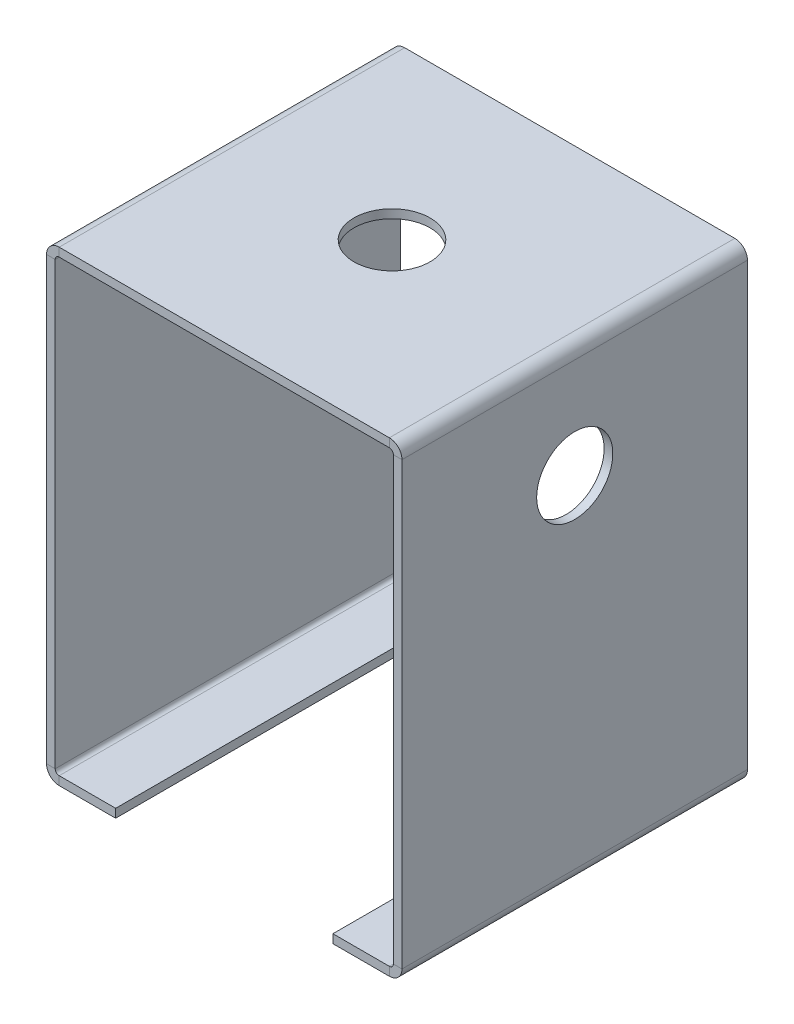
ISO-10303-21;
HEADER;
FILE_DESCRIPTION(('STEP AP214'),'2;1');
FILE_NAME('part.step','',(''),(''),'','','');
FILE_SCHEMA(('AUTOMOTIVE_DESIGN { 1 0 10303 214 1 1 1 1 }'));
ENDSEC;
DATA;
#1=APPLICATION_CONTEXT('core data for automotive mechanical design processes');
#2=APPLICATION_PROTOCOL_DEFINITION('international standard','automotive_design',2000,#1);
#3=PRODUCT_CONTEXT('',#1,'mechanical');
#4=PRODUCT('Part','Part','',(#3));
#5=PRODUCT_RELATED_PRODUCT_CATEGORY('part','',(#4));
#6=PRODUCT_DEFINITION_FORMATION('','',#4);
#7=PRODUCT_DEFINITION_CONTEXT('part definition',#1,'design');
#8=PRODUCT_DEFINITION('design','',#6,#7);
#9=PRODUCT_DEFINITION_SHAPE('','',#8);
#10=(LENGTH_UNIT() NAMED_UNIT(*) SI_UNIT(.MILLI.,.METRE.));
#11=(NAMED_UNIT(*) PLANE_ANGLE_UNIT() SI_UNIT($,.RADIAN.));
#12=(NAMED_UNIT(*) SI_UNIT($,.STERADIAN.) SOLID_ANGLE_UNIT());
#13=UNCERTAINTY_MEASURE_WITH_UNIT(LENGTH_MEASURE(1.E-05),#10,'distance_accuracy_value','');
#14=(GEOMETRIC_REPRESENTATION_CONTEXT(3) GLOBAL_UNCERTAINTY_ASSIGNED_CONTEXT((#13)) GLOBAL_UNIT_ASSIGNED_CONTEXT((#10,
#11,#12)) REPRESENTATION_CONTEXT('',''));
#15=CARTESIAN_POINT('',(0.,0.,0.));
#16=DIRECTION('',(0.,0.,1.));
#17=DIRECTION('',(1.,0.,0.));
#18=AXIS2_PLACEMENT_3D('',#15,#16,#17);
#19=CARTESIAN_POINT('',(-63.7499999440006,2.19380097704199E-13,0.));
#20=DIRECTION('',(0.,0.,1.));
#21=DIRECTION('',(1.,0.,0.));
#22=AXIS2_PLACEMENT_3D('',#19,#20,#21);
#23=PLANE('',#22);
#24=DIRECTION('',(-1.,0.,0.));
#25=VECTOR('',#24,1.);
#26=CARTESIAN_POINT('',(-62.1624999440006,0.736600000000206,0.));
#27=LINE('',#26,#25);
#28=CARTESIAN_POINT('',(-62.1624999440006,0.736600000000201,0.));
#29=VERTEX_POINT('',#28);
#30=CARTESIAN_POINT('',(-63.7499999440006,0.736600000000207,0.));
#31=VERTEX_POINT('',#30);
#32=EDGE_CURVE('E236',#29,#31,#27,.T.);
#33=ORIENTED_EDGE('',*,*,#32,.T.);
#34=DIRECTION('',(0.,-1.,0.));
#35=VECTOR('',#34,1.);
#36=CARTESIAN_POINT('',(-63.7499999440006,2.19380097704199E-13,0.));
#37=LINE('',#36,#35);
#38=CARTESIAN_POINT('',(-63.749999944,81.8134000000002,0.));
#39=VERTEX_POINT('',#38);
#40=EDGE_CURVE('E259',#39,#31,#37,.T.);
#41=ORIENTED_EDGE('',*,*,#40,.F.);
#42=DIRECTION('',(-1.,0.,0.));
#43=VECTOR('',#42,1.);
#44=CARTESIAN_POINT('',(-62.162499944,81.8134000000002,0.));
#45=LINE('',#44,#43);
#46=CARTESIAN_POINT('',(-62.162499944,81.8134000000002,0.));
#47=VERTEX_POINT('',#46);
#48=EDGE_CURVE('E250',#47,#39,#45,.T.);
#49=ORIENTED_EDGE('',*,*,#48,.F.);
#50=DIRECTION('',(0.,-1.,0.));
#51=VECTOR('',#50,1.);
#52=CARTESIAN_POINT('',(-62.1624999440006,2.08166817117217E-13,0.));
#53=LINE('',#52,#51);
#54=EDGE_CURVE('E258',#47,#29,#53,.T.);
#55=ORIENTED_EDGE('',*,*,#54,.T.);
#56=EDGE_LOOP('',(#33,#41,#49,#55));
#57=FACE_BOUND('',#56,.T.);
#58=ADVANCED_FACE('F39',(#57),#23,.F.);
#59=CARTESIAN_POINT('',(-63.749999944,82.5500000000002,63.5));
#60=DIRECTION('',(0.,0.,-1.));
#61=DIRECTION('',(-1.,0.,0.));
#62=AXIS2_PLACEMENT_3D('',#59,#60,#61);
#63=PLANE('',#62);
#64=DIRECTION('',(-1.,0.,0.));
#65=VECTOR('',#64,1.);
#66=CARTESIAN_POINT('',(-62.1624999440006,0.736600000000197,63.5));
#67=LINE('',#66,#65);
#68=CARTESIAN_POINT('',(-62.1624999440006,0.736600000000197,63.5));
#69=VERTEX_POINT('',#68);
#70=CARTESIAN_POINT('',(-63.7499999440006,0.736600000000208,63.5));
#71=VERTEX_POINT('',#70);
#72=EDGE_CURVE('E242',#69,#71,#67,.T.);
#73=ORIENTED_EDGE('',*,*,#72,.F.);
#74=DIRECTION('',(0.,1.,0.));
#75=VECTOR('',#74,1.);
#76=CARTESIAN_POINT('',(-62.162499944,82.5500000000002,63.5));
#77=LINE('',#76,#75);
#78=CARTESIAN_POINT('',(-62.162499944,81.8134000000002,63.5));
#79=VERTEX_POINT('',#78);
#80=EDGE_CURVE('E262',#69,#79,#77,.T.);
#81=ORIENTED_EDGE('',*,*,#80,.T.);
#82=DIRECTION('',(-1.,0.,0.));
#83=VECTOR('',#82,1.);
#84=CARTESIAN_POINT('',(-62.162499944,81.8134000000002,63.5));
#85=LINE('',#84,#83);
#86=CARTESIAN_POINT('',(-63.749999944,81.8134000000002,63.5));
#87=VERTEX_POINT('',#86);
#88=EDGE_CURVE('E245',#79,#87,#85,.T.);
#89=ORIENTED_EDGE('',*,*,#88,.T.);
#90=DIRECTION('',(0.,1.,0.));
#91=VECTOR('',#90,1.);
#92=CARTESIAN_POINT('',(-63.749999944,82.5500000000002,63.5));
#93=LINE('',#92,#91);
#94=EDGE_CURVE('E261',#71,#87,#93,.T.);
#95=ORIENTED_EDGE('',*,*,#94,.F.);
#96=EDGE_LOOP('',(#73,#81,#89,#95));
#97=FACE_BOUND('',#96,.T.);
#98=ADVANCED_FACE('F457',(#97),#63,.F.);
#99=CARTESIAN_POINT('',(-63.7499999440006,4.50128790225952E-13,0.));
#100=DIRECTION('',(1.,0.,0.));
#101=DIRECTION('',(0.,1.,0.));
#102=AXIS2_PLACEMENT_3D('',#99,#100,#101);
#103=PLANE('',#102);
#104=DIRECTION('',(0.,0.,-1.));
#105=VECTOR('',#104,1.);
#106=CARTESIAN_POINT('',(-63.7499999440006,0.736600000000207,0.));
#107=LINE('',#106,#105);
#108=EDGE_CURVE('E189',#31,#71,#107,.F.);
#109=ORIENTED_EDGE('',*,*,#108,.T.);
#110=ORIENTED_EDGE('',*,*,#94,.T.);
#111=DIRECTION('',(0.,0.,1.));
#112=VECTOR('',#111,1.);
#113=CARTESIAN_POINT('',(-63.749999944,81.8134000000002,0.));
#114=LINE('',#113,#112);
#115=EDGE_CURVE('E253',#39,#87,#114,.T.);
#116=ORIENTED_EDGE('',*,*,#115,.F.);
#117=ORIENTED_EDGE('',*,*,#40,.T.);
#118=EDGE_LOOP('',(#109,#110,#116,#117));
#119=FACE_BOUND('',#118,.T.);
#120=ADVANCED_FACE('F462',(#119),#103,.F.);
#121=CARTESIAN_POINT('',(-62.1624999440006,4.3891550963897E-13,0.));
#122=DIRECTION('',(1.,0.,0.));
#123=DIRECTION('',(0.,1.,0.));
#124=AXIS2_PLACEMENT_3D('',#121,#122,#123);
#125=PLANE('',#124);
#126=ORIENTED_EDGE('',*,*,#80,.F.);
#127=DIRECTION('',(0.,0.,-1.));
#128=VECTOR('',#127,1.);
#129=CARTESIAN_POINT('',(-62.1624999440006,0.736600000000206,0.));
#130=LINE('',#129,#128);
#131=EDGE_CURVE('E56',#29,#69,#130,.F.);
#132=ORIENTED_EDGE('',*,*,#131,.F.);
#133=ORIENTED_EDGE('',*,*,#54,.F.);
#134=DIRECTION('',(0.,0.,-1.));
#135=VECTOR('',#134,1.);
#136=CARTESIAN_POINT('',(-62.162499944,81.8134000000002,63.5));
#137=LINE('',#136,#135);
#138=EDGE_CURVE('E248',#79,#47,#137,.T.);
#139=ORIENTED_EDGE('',*,*,#138,.F.);
#140=EDGE_LOOP('',(#126,#132,#133,#139));
#141=FACE_BOUND('',#140,.T.);
#142=ADVANCED_FACE('F422',(#141),#125,.T.);
#143=CARTESIAN_POINT('',(0.,84.1375,63.5));
#144=DIRECTION('',(0.,0.,-1.));
#145=DIRECTION('',(-1.,0.,0.));
#146=AXIS2_PLACEMENT_3D('',#143,#144,#145);
#147=PLANE('',#146);
#148=DIRECTION('',(0.,1.,0.));
#149=VECTOR('',#148,1.);
#150=CARTESIAN_POINT('',(-61.425899944,82.5500000000002,63.5));
#151=LINE('',#150,#149);
#152=CARTESIAN_POINT('',(-61.425899944,82.5500000000002,63.5));
#153=VERTEX_POINT('',#152);
#154=CARTESIAN_POINT('',(-61.425899944,84.1375000000002,63.5));
#155=VERTEX_POINT('',#154);
#156=EDGE_CURVE('E282',#153,#155,#151,.T.);
#157=ORIENTED_EDGE('',*,*,#156,.F.);
#158=DIRECTION('',(1.,0.,0.));
#159=VECTOR('',#158,1.);
#160=CARTESIAN_POINT('',(0.,82.55,63.5));
#161=LINE('',#160,#159);
#162=CARTESIAN_POINT('',(-0.736600000000004,82.55,63.5));
#163=VERTEX_POINT('',#162);
#164=EDGE_CURVE('E298',#153,#163,#161,.T.);
#165=ORIENTED_EDGE('',*,*,#164,.T.);
#166=DIRECTION('',(0.,1.,0.));
#167=VECTOR('',#166,1.);
#168=CARTESIAN_POINT('',(-0.736600000000004,82.55,63.5));
#169=LINE('',#168,#167);
#170=CARTESIAN_POINT('',(-0.736599999999998,84.1375,63.5));
#171=VERTEX_POINT('',#170);
#172=EDGE_CURVE('E285',#163,#171,#169,.T.);
#173=ORIENTED_EDGE('',*,*,#172,.T.);
#174=DIRECTION('',(1.,0.,0.));
#175=VECTOR('',#174,1.);
#176=CARTESIAN_POINT('',(0.,84.1375,63.5));
#177=LINE('',#176,#175);
#178=EDGE_CURVE('E299',#155,#171,#177,.T.);
#179=ORIENTED_EDGE('',*,*,#178,.F.);
#180=EDGE_LOOP('',(#157,#165,#173,#179));
#181=FACE_BOUND('',#180,.T.);
#182=ADVANCED_FACE('F580',(#181),#147,.F.);
#183=CARTESIAN_POINT('',(-62.162499944,84.1375000000002,0.));
#184=DIRECTION('',(0.,0.,1.));
#185=DIRECTION('',(1.,0.,0.));
#186=AXIS2_PLACEMENT_3D('',#183,#184,#185);
#187=PLANE('',#186);
#188=DIRECTION('',(0.,1.,0.));
#189=VECTOR('',#188,1.);
#190=CARTESIAN_POINT('',(-61.425899944,82.5500000000002,0.));
#191=LINE('',#190,#189);
#192=CARTESIAN_POINT('',(-61.425899944,82.5500000000002,0.));
#193=VERTEX_POINT('',#192);
#194=CARTESIAN_POINT('',(-61.425899944,84.1375000000002,0.));
#195=VERTEX_POINT('',#194);
#196=EDGE_CURVE('E273',#193,#195,#191,.T.);
#197=ORIENTED_EDGE('',*,*,#196,.T.);
#198=DIRECTION('',(-1.,0.,0.));
#199=VECTOR('',#198,1.);
#200=CARTESIAN_POINT('',(-62.162499944,84.1375000000002,0.));
#201=LINE('',#200,#199);
#202=CARTESIAN_POINT('',(-0.736599999999998,84.1375,0.));
#203=VERTEX_POINT('',#202);
#204=EDGE_CURVE('E301',#203,#195,#201,.T.);
#205=ORIENTED_EDGE('',*,*,#204,.F.);
#206=DIRECTION('',(0.,1.,0.));
#207=VECTOR('',#206,1.);
#208=CARTESIAN_POINT('',(-0.736600000000004,82.55,0.));
#209=LINE('',#208,#207);
#210=CARTESIAN_POINT('',(-0.736600000000004,82.55,0.));
#211=VERTEX_POINT('',#210);
#212=EDGE_CURVE('E290',#211,#203,#209,.T.);
#213=ORIENTED_EDGE('',*,*,#212,.F.);
#214=DIRECTION('',(-1.,0.,0.));
#215=VECTOR('',#214,1.);
#216=CARTESIAN_POINT('',(-62.162499944,82.5500000000002,0.));
#217=LINE('',#216,#215);
#218=EDGE_CURVE('E302',#211,#193,#217,.T.);
#219=ORIENTED_EDGE('',*,*,#218,.T.);
#220=EDGE_LOOP('',(#197,#205,#213,#219));
#221=FACE_BOUND('',#220,.T.);
#222=ADVANCED_FACE('F411',(#221),#187,.F.);
#223=CARTESIAN_POINT('',(3.00411532627006E-13,84.1375,0.));
#224=DIRECTION('',(0.,-1.,0.));
#225=DIRECTION('',(1.,0.,0.));
#226=AXIS2_PLACEMENT_3D('',#223,#224,#225);
#227=PLANE('',#226);
#228=CARTESIAN_POINT('',(-32.,84.1375000000001,31.75));
#229=DIRECTION('',(0.,1.,0.));
#230=DIRECTION('',(-1.,0.,0.));
#231=AXIS2_PLACEMENT_3D('',#228,#229,#230);
#232=CIRCLE('',#231,7.);
#233=CARTESIAN_POINT('',(-39.,84.1375000000001,31.75));
#234=VERTEX_POINT('',#233);
#235=EDGE_CURVE('E435',#234,#234,#232,.T.);
#236=ORIENTED_EDGE('',*,*,#235,.F.);
#237=EDGE_LOOP('',(#236));
#238=FACE_BOUND('',#237,.T.);
#239=DIRECTION('',(0.,0.,-1.));
#240=VECTOR('',#239,1.);
#241=CARTESIAN_POINT('',(-61.425899944,84.1375000000002,0.));
#242=LINE('',#241,#240);
#243=EDGE_CURVE('E267',#195,#155,#242,.F.);
#244=ORIENTED_EDGE('',*,*,#243,.T.);
#245=ORIENTED_EDGE('',*,*,#178,.T.);
#246=DIRECTION('',(0.,0.,1.));
#247=VECTOR('',#246,1.);
#248=CARTESIAN_POINT('',(-0.736599999999998,84.1375,0.));
#249=LINE('',#248,#247);
#250=EDGE_CURVE('E293',#203,#171,#249,.T.);
#251=ORIENTED_EDGE('',*,*,#250,.F.);
#252=ORIENTED_EDGE('',*,*,#204,.T.);
#253=EDGE_LOOP('',(#244,#245,#251,#252));
#254=FACE_BOUND('',#253,.T.);
#255=ADVANCED_FACE('F445',(#238,#254),#227,.F.);
#256=CARTESIAN_POINT('',(2.94868806001592E-13,82.55,0.));
#257=DIRECTION('',(0.,-1.,0.));
#258=DIRECTION('',(1.,0.,0.));
#259=AXIS2_PLACEMENT_3D('',#256,#257,#258);
#260=PLANE('',#259);
#261=CARTESIAN_POINT('',(-32.,82.5500000000001,31.75));
#262=DIRECTION('',(0.,-1.,0.));
#263=DIRECTION('',(1.,0.,0.));
#264=AXIS2_PLACEMENT_3D('',#261,#262,#263);
#265=CIRCLE('',#264,7.);
#266=CARTESIAN_POINT('',(-25.,82.5500000000001,31.75));
#267=VERTEX_POINT('',#266);
#268=EDGE_CURVE('E43',#267,#267,#265,.T.);
#269=ORIENTED_EDGE('',*,*,#268,.F.);
#270=EDGE_LOOP('',(#269));
#271=FACE_BOUND('',#270,.T.);
#272=ORIENTED_EDGE('',*,*,#164,.F.);
#273=DIRECTION('',(0.,0.,-1.));
#274=VECTOR('',#273,1.);
#275=CARTESIAN_POINT('',(-61.425899944,82.5500000000002,0.));
#276=LINE('',#275,#274);
#277=EDGE_CURVE('E64',#193,#153,#276,.F.);
#278=ORIENTED_EDGE('',*,*,#277,.F.);
#279=ORIENTED_EDGE('',*,*,#218,.F.);
#280=DIRECTION('',(0.,0.,-1.));
#281=VECTOR('',#280,1.);
#282=CARTESIAN_POINT('',(-0.736600000000004,82.55,63.5));
#283=LINE('',#282,#281);
#284=EDGE_CURVE('E288',#163,#211,#283,.T.);
#285=ORIENTED_EDGE('',*,*,#284,.F.);
#286=EDGE_LOOP('',(#272,#278,#279,#285));
#287=FACE_BOUND('',#286,.T.);
#288=ADVANCED_FACE('F408',(#271,#287),#260,.T.);
#289=CARTESIAN_POINT('',(1.5875,0.,63.5));
#290=DIRECTION('',(-1.,0.,0.));
#291=DIRECTION('',(0.,0.,1.));
#292=AXIS2_PLACEMENT_3D('',#289,#290,#291);
#293=PLANE('',#292);
#294=CARTESIAN_POINT('',(1.5875,63.4125,31.75));
#295=DIRECTION('',(-1.,0.,0.));
#296=DIRECTION('',(0.,0.,1.));
#297=AXIS2_PLACEMENT_3D('',#294,#295,#296);
#298=CIRCLE('',#297,7.);
#299=CARTESIAN_POINT('',(1.5875,63.4125,38.75));
#300=VERTEX_POINT('',#299);
#301=EDGE_CURVE('E330',#300,#300,#298,.T.);
#302=ORIENTED_EDGE('',*,*,#301,.T.);
#303=EDGE_LOOP('',(#302));
#304=FACE_BOUND('',#303,.T.);
#305=DIRECTION('',(0.,0.,-1.));
#306=VECTOR('',#305,1.);
#307=CARTESIAN_POINT('',(1.5875,81.8134,0.));
#308=LINE('',#307,#306);
#309=CARTESIAN_POINT('',(1.5875,81.8134,0.));
#310=VERTEX_POINT('',#309);
#311=CARTESIAN_POINT('',(1.5875,81.8134,63.5));
#312=VERTEX_POINT('',#311);
#313=EDGE_CURVE('E307',#310,#312,#308,.F.);
#314=ORIENTED_EDGE('',*,*,#313,.T.);
#315=DIRECTION('',(0.,1.,0.));
#316=VECTOR('',#315,1.);
#317=CARTESIAN_POINT('',(1.5875,0.,63.5));
#318=LINE('',#317,#316);
#319=CARTESIAN_POINT('',(1.5875,0.736599999999993,63.5));
#320=VERTEX_POINT('',#319);
#321=EDGE_CURVE('E48',#320,#312,#318,.T.);
#322=ORIENTED_EDGE('',*,*,#321,.F.);
#323=DIRECTION('',(0.,0.,1.));
#324=VECTOR('',#323,1.);
#325=CARTESIAN_POINT('',(1.5875,0.736599999999993,63.5));
#326=LINE('',#325,#324);
#327=CARTESIAN_POINT('',(1.5875,0.736599999999993,0.));
#328=VERTEX_POINT('',#327);
#329=EDGE_CURVE('E366',#320,#328,#326,.F.);
#330=ORIENTED_EDGE('',*,*,#329,.T.);
#331=DIRECTION('',(0.,1.,0.));
#332=VECTOR('',#331,1.);
#333=CARTESIAN_POINT('',(1.5875,0.,0.));
#334=LINE('',#333,#332);
#335=EDGE_CURVE('E387',#328,#310,#334,.T.);
#336=ORIENTED_EDGE('',*,*,#335,.T.);
#337=EDGE_LOOP('',(#314,#322,#330,#336));
#338=FACE_BOUND('',#337,.T.);
#339=ADVANCED_FACE('F41',(#304,#338),#293,.F.);
#340=CARTESIAN_POINT('',(0.,0.,63.5));
#341=DIRECTION('',(-1.,0.,0.));
#342=DIRECTION('',(0.,0.,1.));
#343=AXIS2_PLACEMENT_3D('',#340,#341,#342);
#344=PLANE('',#343);
#345=CARTESIAN_POINT('',(0.,63.4125,31.75));
#346=DIRECTION('',(-1.,0.,0.));
#347=DIRECTION('',(0.,0.,1.));
#348=AXIS2_PLACEMENT_3D('',#345,#346,#347);
#349=CIRCLE('',#348,7.);
#350=CARTESIAN_POINT('',(0.,63.4125,38.75));
#351=VERTEX_POINT('',#350);
#352=EDGE_CURVE('E327',#351,#351,#349,.T.);
#353=ORIENTED_EDGE('',*,*,#352,.F.);
#354=EDGE_LOOP('',(#353));
#355=FACE_BOUND('',#354,.T.);
#356=DIRECTION('',(0.,1.,0.));
#357=VECTOR('',#356,1.);
#358=CARTESIAN_POINT('',(0.,0.,63.5));
#359=LINE('',#358,#357);
#360=CARTESIAN_POINT('',(0.,0.736599999999997,63.5));
#361=VERTEX_POINT('',#360);
#362=CARTESIAN_POINT('',(0.,81.8134,63.5));
#363=VERTEX_POINT('',#362);
#364=EDGE_CURVE('E11',#361,#363,#359,.T.);
#365=ORIENTED_EDGE('',*,*,#364,.T.);
#366=DIRECTION('',(0.,0.,-1.));
#367=VECTOR('',#366,1.);
#368=CARTESIAN_POINT('',(0.,81.8134,0.));
#369=LINE('',#368,#367);
#370=CARTESIAN_POINT('',(0.,81.8134,0.));
#371=VERTEX_POINT('',#370);
#372=EDGE_CURVE('E319',#371,#363,#369,.F.);
#373=ORIENTED_EDGE('',*,*,#372,.F.);
#374=DIRECTION('',(0.,1.,0.));
#375=VECTOR('',#374,1.);
#376=CARTESIAN_POINT('',(0.,0.,0.));
#377=LINE('',#376,#375);
#378=CARTESIAN_POINT('',(0.,0.736599999999993,0.));
#379=VERTEX_POINT('',#378);
#380=EDGE_CURVE('E391',#379,#371,#377,.T.);
#381=ORIENTED_EDGE('',*,*,#380,.F.);
#382=DIRECTION('',(0.,0.,1.));
#383=VECTOR('',#382,1.);
#384=CARTESIAN_POINT('',(0.,0.736599999999997,63.5));
#385=LINE('',#384,#383);
#386=EDGE_CURVE('E379',#361,#379,#385,.F.);
#387=ORIENTED_EDGE('',*,*,#386,.F.);
#388=EDGE_LOOP('',(#365,#373,#381,#387));
#389=FACE_BOUND('',#388,.T.);
#390=ADVANCED_FACE('F451',(#355,#389),#344,.T.);
#391=CARTESIAN_POINT('',(0.,0.,63.5));
#392=DIRECTION('',(0.,0.,-1.));
#393=DIRECTION('',(-1.,0.,0.));
#394=AXIS2_PLACEMENT_3D('',#391,#392,#393);
#395=PLANE('',#394);
#396=DIRECTION('',(1.,0.,0.));
#397=VECTOR('',#396,1.);
#398=CARTESIAN_POINT('',(0.,81.8134,63.5));
#399=LINE('',#398,#397);
#400=EDGE_CURVE('E324',#363,#312,#399,.T.);
#401=ORIENTED_EDGE('',*,*,#400,.F.);
#402=ORIENTED_EDGE('',*,*,#364,.F.);
#403=DIRECTION('',(1.,0.,0.));
#404=VECTOR('',#403,1.);
#405=CARTESIAN_POINT('',(0.,0.736599999999997,63.5));
#406=LINE('',#405,#404);
#407=EDGE_CURVE('E373',#361,#320,#406,.T.);
#408=ORIENTED_EDGE('',*,*,#407,.T.);
#409=ORIENTED_EDGE('',*,*,#321,.T.);
#410=EDGE_LOOP('',(#401,#402,#408,#409));
#411=FACE_BOUND('',#410,.T.);
#412=ADVANCED_FACE('F743',(#411),#395,.F.);
#413=CARTESIAN_POINT('',(0.,0.,0.));
#414=DIRECTION('',(0.,0.,-1.));
#415=DIRECTION('',(-1.,0.,0.));
#416=AXIS2_PLACEMENT_3D('',#413,#414,#415);
#417=PLANE('',#416);
#418=ORIENTED_EDGE('',*,*,#380,.T.);
#419=DIRECTION('',(1.,0.,0.));
#420=VECTOR('',#419,1.);
#421=CARTESIAN_POINT('',(0.,81.8134,0.));
#422=LINE('',#421,#420);
#423=EDGE_CURVE('E313',#371,#310,#422,.T.);
#424=ORIENTED_EDGE('',*,*,#423,.T.);
#425=ORIENTED_EDGE('',*,*,#335,.F.);
#426=DIRECTION('',(1.,0.,0.));
#427=VECTOR('',#426,1.);
#428=CARTESIAN_POINT('',(0.,0.736599999999993,0.));
#429=LINE('',#428,#427);
#430=EDGE_CURVE('E384',#379,#328,#429,.T.);
#431=ORIENTED_EDGE('',*,*,#430,.F.);
#432=EDGE_LOOP('',(#418,#424,#425,#431));
#433=FACE_BOUND('',#432,.T.);
#434=ADVANCED_FACE('F397',(#433),#417,.T.);
#435=CARTESIAN_POINT('',(-0.7366,0.736599999999995,0.));
#436=DIRECTION('',(0.,0.,-1.));
#437=DIRECTION('',(0.,1.,0.));
#438=AXIS2_PLACEMENT_3D('',#435,#436,#437);
#439=PLANE('',#438);
#440=DIRECTION('',(0.,-1.,0.));
#441=VECTOR('',#440,1.);
#442=CARTESIAN_POINT('',(-0.736599999999997,0.,0.));
#443=LINE('',#442,#441);
#444=CARTESIAN_POINT('',(-0.736599999999997,0.,0.));
#445=VERTEX_POINT('',#444);
#446=CARTESIAN_POINT('',(-0.736599999999992,-1.5875,0.));
#447=VERTEX_POINT('',#446);
#448=EDGE_CURVE('E333',#445,#447,#443,.T.);
#449=ORIENTED_EDGE('',*,*,#448,.F.);
#450=CARTESIAN_POINT('',(-0.7366,0.736599999999995,0.));
#451=DIRECTION('',(0.,0.,1.));
#452=DIRECTION('',(0.,-1.,0.));
#453=AXIS2_PLACEMENT_3D('',#450,#451,#452);
#454=CIRCLE('',#453,0.736599999999998);
#455=EDGE_CURVE('E376',#379,#445,#454,.F.);
#456=ORIENTED_EDGE('',*,*,#455,.F.);
#457=ORIENTED_EDGE('',*,*,#430,.T.);
#458=CARTESIAN_POINT('',(-0.7366,0.736599999999995,0.));
#459=DIRECTION('',(0.,0.,1.));
#460=DIRECTION('',(0.,-1.,0.));
#461=AXIS2_PLACEMENT_3D('',#458,#459,#460);
#462=CIRCLE('',#461,2.3241);
#463=EDGE_CURVE('E369',#328,#447,#462,.F.);
#464=ORIENTED_EDGE('',*,*,#463,.T.);
#465=EDGE_LOOP('',(#449,#456,#457,#464));
#466=FACE_BOUND('',#465,.T.);
#467=ADVANCED_FACE('F762',(#466),#439,.T.);
#468=CARTESIAN_POINT('',(-0.7366,0.7366,63.5));
#469=DIRECTION('',(0.,0.,-1.));
#470=DIRECTION('',(0.,1.,0.));
#471=AXIS2_PLACEMENT_3D('',#468,#469,#470);
#472=PLANE('',#471);
#473=CARTESIAN_POINT('',(-0.7366,0.7366,63.5));
#474=DIRECTION('',(0.,0.,1.));
#475=DIRECTION('',(0.,-1.,0.));
#476=AXIS2_PLACEMENT_3D('',#473,#474,#475);
#477=CIRCLE('',#476,0.736599999999998);
#478=CARTESIAN_POINT('',(-0.736599999999997,0.,63.5));
#479=VERTEX_POINT('',#478);
#480=EDGE_CURVE('E365',#479,#361,#477,.T.);
#481=ORIENTED_EDGE('',*,*,#480,.F.);
#482=DIRECTION('',(0.,-1.,0.));
#483=VECTOR('',#482,1.);
#484=CARTESIAN_POINT('',(-0.736599999999997,0.,63.5));
#485=LINE('',#484,#483);
#486=CARTESIAN_POINT('',(-0.736599999999992,-1.5875,63.5));
#487=VERTEX_POINT('',#486);
#488=EDGE_CURVE('E338',#479,#487,#485,.T.);
#489=ORIENTED_EDGE('',*,*,#488,.T.);
#490=CARTESIAN_POINT('',(-0.7366,0.7366,63.5));
#491=DIRECTION('',(0.,0.,1.));
#492=DIRECTION('',(0.,-1.,0.));
#493=AXIS2_PLACEMENT_3D('',#490,#491,#492);
#494=CIRCLE('',#493,2.3241);
#495=EDGE_CURVE('E370',#487,#320,#494,.T.);
#496=ORIENTED_EDGE('',*,*,#495,.T.);
#497=ORIENTED_EDGE('',*,*,#407,.F.);
#498=EDGE_LOOP('',(#481,#489,#496,#497));
#499=FACE_BOUND('',#498,.T.);
#500=ADVANCED_FACE('F847',(#499),#472,.F.);
#501=CARTESIAN_POINT('',(-0.7366,0.7366,63.5));
#502=DIRECTION('',(0.,0.,1.));
#503=DIRECTION('',(0.,-1.,0.));
#504=AXIS2_PLACEMENT_3D('',#501,#502,#503);
#505=CYLINDRICAL_SURFACE('',#504,2.3241);
#506=ORIENTED_EDGE('',*,*,#329,.F.);
#507=ORIENTED_EDGE('',*,*,#495,.F.);
#508=DIRECTION('',(0.,0.,-1.));
#509=VECTOR('',#508,1.);
#510=CARTESIAN_POINT('',(-0.736599999999992,-1.5875,0.));
#511=LINE('',#510,#509);
#512=EDGE_CURVE('E341',#487,#447,#511,.T.);
#513=ORIENTED_EDGE('',*,*,#512,.T.);
#514=ORIENTED_EDGE('',*,*,#463,.F.);
#515=EDGE_LOOP('',(#506,#507,#513,#514));
#516=FACE_BOUND('',#515,.T.);
#517=ADVANCED_FACE('F836',(#516),#505,.T.);
#518=CARTESIAN_POINT('',(-0.7366,0.7366,63.5));
#519=DIRECTION('',(0.,0.,1.));
#520=DIRECTION('',(0.,-1.,0.));
#521=AXIS2_PLACEMENT_3D('',#518,#519,#520);
#522=CYLINDRICAL_SURFACE('',#521,0.736599999999998);
#523=ORIENTED_EDGE('',*,*,#386,.T.);
#524=ORIENTED_EDGE('',*,*,#455,.T.);
#525=DIRECTION('',(0.,0.,1.));
#526=VECTOR('',#525,1.);
#527=CARTESIAN_POINT('',(-0.736599999999997,0.,0.));
#528=LINE('',#527,#526);
#529=EDGE_CURVE('E336',#445,#479,#528,.T.);
#530=ORIENTED_EDGE('',*,*,#529,.T.);
#531=ORIENTED_EDGE('',*,*,#480,.T.);
#532=EDGE_LOOP('',(#523,#524,#530,#531));
#533=FACE_BOUND('',#532,.T.);
#534=ADVANCED_FACE('F825',(#533),#522,.F.);
#535=CARTESIAN_POINT('',(-11.1125,-1.58750000000004,63.5));
#536=DIRECTION('',(0.,0.,-1.));
#537=DIRECTION('',(-1.,0.,0.));
#538=AXIS2_PLACEMENT_3D('',#535,#536,#537);
#539=PLANE('',#538);
#540=ORIENTED_EDGE('',*,*,#488,.F.);
#541=DIRECTION('',(-1.,0.,0.));
#542=VECTOR('',#541,1.);
#543=CARTESIAN_POINT('',(-11.1125,0.,63.5));
#544=LINE('',#543,#542);
#545=CARTESIAN_POINT('',(-11.1125,0.,63.5));
#546=VERTEX_POINT('',#545);
#547=EDGE_CURVE('E345',#479,#546,#544,.T.);
#548=ORIENTED_EDGE('',*,*,#547,.T.);
#549=DIRECTION('',(0.,1.,0.));
#550=VECTOR('',#549,1.);
#551=CARTESIAN_POINT('',(-11.1125,-1.58750000000004,63.5));
#552=LINE('',#551,#550);
#553=CARTESIAN_POINT('',(-11.1125,-1.58750000000004,63.5));
#554=VERTEX_POINT('',#553);
#555=EDGE_CURVE('E362',#554,#546,#552,.T.);
#556=ORIENTED_EDGE('',*,*,#555,.F.);
#557=DIRECTION('',(-1.,0.,0.));
#558=VECTOR('',#557,1.);
#559=CARTESIAN_POINT('',(-11.1125,-1.58750000000004,63.5));
#560=LINE('',#559,#558);
#561=EDGE_CURVE('E346',#487,#554,#560,.T.);
#562=ORIENTED_EDGE('',*,*,#561,.F.);
#563=EDGE_LOOP('',(#540,#548,#556,#562));
#564=FACE_BOUND('',#563,.T.);
#565=ADVANCED_FACE('F814',(#564),#539,.F.);
#566=CARTESIAN_POINT('',(0.,-1.5875,0.));
#567=DIRECTION('',(0.,0.,1.));
#568=DIRECTION('',(1.,0.,0.));
#569=AXIS2_PLACEMENT_3D('',#566,#567,#568);
#570=PLANE('',#569);
#571=ORIENTED_EDGE('',*,*,#448,.T.);
#572=DIRECTION('',(1.,0.,0.));
#573=VECTOR('',#572,1.);
#574=CARTESIAN_POINT('',(0.,-1.5875,0.));
#575=LINE('',#574,#573);
#576=CARTESIAN_POINT('',(-11.1125,-1.58750000000004,0.));
#577=VERTEX_POINT('',#576);
#578=EDGE_CURVE('E351',#577,#447,#575,.T.);
#579=ORIENTED_EDGE('',*,*,#578,.F.);
#580=DIRECTION('',(0.,1.,0.));
#581=VECTOR('',#580,1.);
#582=CARTESIAN_POINT('',(-11.1125,-1.58750000000004,0.));
#583=LINE('',#582,#581);
#584=CARTESIAN_POINT('',(-11.1125,0.,0.));
#585=VERTEX_POINT('',#584);
#586=EDGE_CURVE('E354',#577,#585,#583,.T.);
#587=ORIENTED_EDGE('',*,*,#586,.T.);
#588=DIRECTION('',(1.,0.,0.));
#589=VECTOR('',#588,1.);
#590=CARTESIAN_POINT('',(0.,0.,0.));
#591=LINE('',#590,#589);
#592=EDGE_CURVE('E349',#585,#445,#591,.T.);
#593=ORIENTED_EDGE('',*,*,#592,.T.);
#594=EDGE_LOOP('',(#571,#579,#587,#593));
#595=FACE_BOUND('',#594,.T.);
#596=ADVANCED_FACE('F803',(#595),#570,.F.);
#597=CARTESIAN_POINT('',(0.,-1.5875,0.));
#598=DIRECTION('',(0.,1.,0.));
#599=DIRECTION('',(-1.,0.,0.));
#600=AXIS2_PLACEMENT_3D('',#597,#598,#599);
#601=PLANE('',#600);
#602=ORIENTED_EDGE('',*,*,#512,.F.);
#603=ORIENTED_EDGE('',*,*,#561,.T.);
#604=DIRECTION('',(0.,0.,-1.));
#605=VECTOR('',#604,1.);
#606=CARTESIAN_POINT('',(-11.1125,-1.58750000000004,0.));
#607=LINE('',#606,#605);
#608=EDGE_CURVE('E348',#554,#577,#607,.T.);
#609=ORIENTED_EDGE('',*,*,#608,.T.);
#610=ORIENTED_EDGE('',*,*,#578,.T.);
#611=EDGE_LOOP('',(#602,#603,#609,#610));
#612=FACE_BOUND('',#611,.T.);
#613=ADVANCED_FACE('F792',(#612),#601,.F.);
#614=CARTESIAN_POINT('',(0.,0.,0.));
#615=DIRECTION('',(0.,1.,0.));
#616=DIRECTION('',(-1.,0.,0.));
#617=AXIS2_PLACEMENT_3D('',#614,#615,#616);
#618=PLANE('',#617);
#619=ORIENTED_EDGE('',*,*,#547,.F.);
#620=ORIENTED_EDGE('',*,*,#529,.F.);
#621=ORIENTED_EDGE('',*,*,#592,.F.);
#622=DIRECTION('',(0.,0.,-1.));
#623=VECTOR('',#622,1.);
#624=CARTESIAN_POINT('',(-11.1125,0.,0.));
#625=LINE('',#624,#623);
#626=EDGE_CURVE('E356',#546,#585,#625,.T.);
#627=ORIENTED_EDGE('',*,*,#626,.F.);
#628=EDGE_LOOP('',(#619,#620,#621,#627));
#629=FACE_BOUND('',#628,.T.);
#630=ADVANCED_FACE('F781',(#629),#618,.T.);
#631=CARTESIAN_POINT('',(-11.1125,-1.58750000000004,0.));
#632=DIRECTION('',(1.,0.,0.));
#633=DIRECTION('',(0.,1.,0.));
#634=AXIS2_PLACEMENT_3D('',#631,#632,#633);
#635=PLANE('',#634);
#636=ORIENTED_EDGE('',*,*,#626,.T.);
#637=ORIENTED_EDGE('',*,*,#586,.F.);
#638=ORIENTED_EDGE('',*,*,#608,.F.);
#639=ORIENTED_EDGE('',*,*,#555,.T.);
#640=EDGE_LOOP('',(#636,#637,#638,#639));
#641=FACE_BOUND('',#640,.T.);
#642=ADVANCED_FACE('F770',(#641),#635,.F.);
#643=CARTESIAN_POINT('',(1.5875,63.4125,31.75));
#644=DIRECTION('',(-1.,0.,0.));
#645=DIRECTION('',(0.,0.,1.));
#646=AXIS2_PLACEMENT_3D('',#643,#644,#645);
#647=CYLINDRICAL_SURFACE('',#646,7.);
#648=ORIENTED_EDGE('',*,*,#301,.F.);
#649=EDGE_LOOP('',(#648));
#650=FACE_BOUND('',#649,.T.);
#651=ORIENTED_EDGE('',*,*,#352,.T.);
#652=EDGE_LOOP('',(#651));
#653=FACE_BOUND('',#652,.T.);
#654=ADVANCED_FACE('F723',(#650,#653),#647,.F.);
#655=CARTESIAN_POINT('',(-0.736600000000006,81.8134,63.5));
#656=DIRECTION('',(0.,0.,1.));
#657=DIRECTION('',(1.,0.,0.));
#658=AXIS2_PLACEMENT_3D('',#655,#656,#657);
#659=PLANE('',#658);
#660=ORIENTED_EDGE('',*,*,#172,.F.);
#661=CARTESIAN_POINT('',(-0.736600000000006,81.8134,63.5));
#662=DIRECTION('',(0.,0.,-1.));
#663=DIRECTION('',(-1.,0.,0.));
#664=AXIS2_PLACEMENT_3D('',#661,#662,#663);
#665=CIRCLE('',#664,0.736600000000004);
#666=EDGE_CURVE('E316',#363,#163,#665,.F.);
#667=ORIENTED_EDGE('',*,*,#666,.F.);
#668=ORIENTED_EDGE('',*,*,#400,.T.);
#669=CARTESIAN_POINT('',(-0.736600000000006,81.8134,63.5));
#670=DIRECTION('',(0.,0.,-1.));
#671=DIRECTION('',(-1.,0.,0.));
#672=AXIS2_PLACEMENT_3D('',#669,#670,#671);
#673=CIRCLE('',#672,2.3241);
#674=EDGE_CURVE('E309',#312,#171,#673,.F.);
#675=ORIENTED_EDGE('',*,*,#674,.T.);
#676=EDGE_LOOP('',(#660,#667,#668,#675));
#677=FACE_BOUND('',#676,.T.);
#678=ADVANCED_FACE('F713',(#677),#659,.T.);
#679=CARTESIAN_POINT('',(-0.736600000000006,81.8134,0.));
#680=DIRECTION('',(0.,0.,1.));
#681=DIRECTION('',(1.,0.,0.));
#682=AXIS2_PLACEMENT_3D('',#679,#680,#681);
#683=PLANE('',#682);
#684=CARTESIAN_POINT('',(-0.736600000000006,81.8134,0.));
#685=DIRECTION('',(0.,0.,-1.));
#686=DIRECTION('',(-1.,0.,0.));
#687=AXIS2_PLACEMENT_3D('',#684,#685,#686);
#688=CIRCLE('',#687,0.736600000000004);
#689=EDGE_CURVE('E304',#211,#371,#688,.T.);
#690=ORIENTED_EDGE('',*,*,#689,.F.);
#691=ORIENTED_EDGE('',*,*,#212,.T.);
#692=CARTESIAN_POINT('',(-0.736600000000006,81.8134,0.));
#693=DIRECTION('',(0.,0.,-1.));
#694=DIRECTION('',(-1.,0.,0.));
#695=AXIS2_PLACEMENT_3D('',#692,#693,#694);
#696=CIRCLE('',#695,2.3241);
#697=EDGE_CURVE('E310',#203,#310,#696,.T.);
#698=ORIENTED_EDGE('',*,*,#697,.T.);
#699=ORIENTED_EDGE('',*,*,#423,.F.);
#700=EDGE_LOOP('',(#690,#691,#698,#699));
#701=FACE_BOUND('',#700,.T.);
#702=ADVANCED_FACE('F402',(#701),#683,.F.);
#703=CARTESIAN_POINT('',(-0.736600000000006,81.8134,0.));
#704=DIRECTION('',(0.,0.,-1.));
#705=DIRECTION('',(0.,1.,0.));
#706=AXIS2_PLACEMENT_3D('',#703,#704,#705);
#707=CYLINDRICAL_SURFACE('',#706,2.3241);
#708=ORIENTED_EDGE('',*,*,#313,.F.);
#709=ORIENTED_EDGE('',*,*,#697,.F.);
#710=ORIENTED_EDGE('',*,*,#250,.T.);
#711=ORIENTED_EDGE('',*,*,#674,.F.);
#712=EDGE_LOOP('',(#708,#709,#710,#711));
#713=FACE_BOUND('',#712,.T.);
#714=ADVANCED_FACE('F693',(#713),#707,.T.);
#715=CARTESIAN_POINT('',(-0.736600000000006,81.8134,0.));
#716=DIRECTION('',(0.,0.,-1.));
#717=DIRECTION('',(0.,1.,0.));
#718=AXIS2_PLACEMENT_3D('',#715,#716,#717);
#719=CYLINDRICAL_SURFACE('',#718,0.736600000000004);
#720=ORIENTED_EDGE('',*,*,#372,.T.);
#721=ORIENTED_EDGE('',*,*,#666,.T.);
#722=ORIENTED_EDGE('',*,*,#284,.T.);
#723=ORIENTED_EDGE('',*,*,#689,.T.);
#724=EDGE_LOOP('',(#720,#721,#722,#723));
#725=FACE_BOUND('',#724,.T.);
#726=ADVANCED_FACE('F405',(#725),#719,.F.);
#727=CARTESIAN_POINT('',(-61.425899944,81.8134000000002,63.5));
#728=DIRECTION('',(0.,0.,1.));
#729=DIRECTION('',(1.,0.,0.));
#730=AXIS2_PLACEMENT_3D('',#727,#728,#729);
#731=PLANE('',#730);
#732=ORIENTED_EDGE('',*,*,#88,.F.);
#733=CARTESIAN_POINT('',(-61.425899944,81.8134000000002,63.5));
#734=DIRECTION('',(0.,0.,-1.));
#735=DIRECTION('',(-1.,0.,0.));
#736=AXIS2_PLACEMENT_3D('',#733,#734,#735);
#737=CIRCLE('',#736,0.736599999999997);
#738=EDGE_CURVE('E276',#153,#79,#737,.F.);
#739=ORIENTED_EDGE('',*,*,#738,.F.);
#740=ORIENTED_EDGE('',*,*,#156,.T.);
#741=CARTESIAN_POINT('',(-61.425899944,81.8134000000002,63.5));
#742=DIRECTION('',(0.,0.,-1.));
#743=DIRECTION('',(-1.,0.,0.));
#744=AXIS2_PLACEMENT_3D('',#741,#742,#743);
#745=CIRCLE('',#744,2.3241);
#746=EDGE_CURVE('E269',#155,#87,#745,.F.);
#747=ORIENTED_EDGE('',*,*,#746,.T.);
#748=EDGE_LOOP('',(#732,#739,#740,#747));
#749=FACE_BOUND('',#748,.T.);
#750=ADVANCED_FACE('F474',(#749),#731,.T.);
#751=CARTESIAN_POINT('',(-61.425899944,81.8134000000002,0.));
#752=DIRECTION('',(0.,0.,1.));
#753=DIRECTION('',(1.,0.,0.));
#754=AXIS2_PLACEMENT_3D('',#751,#752,#753);
#755=PLANE('',#754);
#756=CARTESIAN_POINT('',(-61.425899944,81.8134000000002,0.));
#757=DIRECTION('',(0.,0.,-1.));
#758=DIRECTION('',(-1.,0.,0.));
#759=AXIS2_PLACEMENT_3D('',#756,#757,#758);
#760=CIRCLE('',#759,0.736599999999997);
#761=EDGE_CURVE('E264',#47,#193,#760,.T.);
#762=ORIENTED_EDGE('',*,*,#761,.F.);
#763=ORIENTED_EDGE('',*,*,#48,.T.);
#764=CARTESIAN_POINT('',(-61.425899944,81.8134000000002,0.));
#765=DIRECTION('',(0.,0.,-1.));
#766=DIRECTION('',(-1.,0.,0.));
#767=AXIS2_PLACEMENT_3D('',#764,#765,#766);
#768=CIRCLE('',#767,2.3241);
#769=EDGE_CURVE('E270',#39,#195,#768,.T.);
#770=ORIENTED_EDGE('',*,*,#769,.T.);
#771=ORIENTED_EDGE('',*,*,#196,.F.);
#772=EDGE_LOOP('',(#762,#763,#770,#771));
#773=FACE_BOUND('',#772,.T.);
#774=ADVANCED_FACE('F416',(#773),#755,.F.);
#775=CARTESIAN_POINT('',(-61.425899944,81.8134000000002,0.));
#776=DIRECTION('',(0.,0.,-1.));
#777=DIRECTION('',(-1.,0.,0.));
#778=AXIS2_PLACEMENT_3D('',#775,#776,#777);
#779=CYLINDRICAL_SURFACE('',#778,2.3241);
#780=ORIENTED_EDGE('',*,*,#243,.F.);
#781=ORIENTED_EDGE('',*,*,#769,.F.);
#782=ORIENTED_EDGE('',*,*,#115,.T.);
#783=ORIENTED_EDGE('',*,*,#746,.F.);
#784=EDGE_LOOP('',(#780,#781,#782,#783));
#785=FACE_BOUND('',#784,.T.);
#786=ADVANCED_FACE('F467',(#785),#779,.T.);
#787=CARTESIAN_POINT('',(-61.425899944,81.8134000000002,0.));
#788=DIRECTION('',(0.,0.,-1.));
#789=DIRECTION('',(-1.,0.,0.));
#790=AXIS2_PLACEMENT_3D('',#787,#788,#789);
#791=CYLINDRICAL_SURFACE('',#790,0.736599999999997);
#792=ORIENTED_EDGE('',*,*,#277,.T.);
#793=ORIENTED_EDGE('',*,*,#738,.T.);
#794=ORIENTED_EDGE('',*,*,#138,.T.);
#795=ORIENTED_EDGE('',*,*,#761,.T.);
#796=EDGE_LOOP('',(#792,#793,#794,#795));
#797=FACE_BOUND('',#796,.T.);
#798=ADVANCED_FACE('F419',(#797),#791,.F.);
#799=CARTESIAN_POINT('',(-61.4258999440006,0.736600000000196,63.5));
#800=DIRECTION('',(0.,0.,1.));
#801=DIRECTION('',(0.,-1.,0.));
#802=AXIS2_PLACEMENT_3D('',#799,#800,#801);
#803=PLANE('',#802);
#804=DIRECTION('',(0.,-1.,0.));
#805=VECTOR('',#804,1.);
#806=CARTESIAN_POINT('',(-61.4258999440006,2.0122792321331E-13,63.5));
#807=LINE('',#806,#805);
#808=CARTESIAN_POINT('',(-61.4258999440006,2.00360561475321E-13,63.5));
#809=VERTEX_POINT('',#808);
#810=CARTESIAN_POINT('',(-61.4258999440006,-1.5874999999998,63.5));
#811=VERTEX_POINT('',#810);
#812=EDGE_CURVE('E431',#809,#811,#807,.T.);
#813=ORIENTED_EDGE('',*,*,#812,.F.);
#814=CARTESIAN_POINT('',(-61.4258999440006,0.736600000000196,63.5));
#815=DIRECTION('',(0.,0.,-1.));
#816=DIRECTION('',(0.,1.,0.));
#817=AXIS2_PLACEMENT_3D('',#814,#815,#816);
#818=CIRCLE('',#817,0.736599999999996);
#819=EDGE_CURVE('E192',#69,#809,#818,.F.);
#820=ORIENTED_EDGE('',*,*,#819,.F.);
#821=ORIENTED_EDGE('',*,*,#72,.T.);
#822=CARTESIAN_POINT('',(-61.4258999440006,0.736600000000196,63.5));
#823=DIRECTION('',(0.,0.,-1.));
#824=DIRECTION('',(0.,1.,0.));
#825=AXIS2_PLACEMENT_3D('',#822,#823,#824);
#826=CIRCLE('',#825,2.3241);
#827=EDGE_CURVE('E235',#71,#811,#826,.F.);
#828=ORIENTED_EDGE('',*,*,#827,.T.);
#829=EDGE_LOOP('',(#813,#820,#821,#828));
#830=FACE_BOUND('',#829,.T.);
#831=ADVANCED_FACE('F473',(#830),#803,.T.);
#832=CARTESIAN_POINT('',(-61.4258999440006,0.736600000000205,0.));
#833=DIRECTION('',(0.,0.,1.));
#834=DIRECTION('',(0.,-1.,0.));
#835=AXIS2_PLACEMENT_3D('',#832,#833,#834);
#836=PLANE('',#835);
#837=CARTESIAN_POINT('',(-61.4258999440006,0.736600000000205,0.));
#838=DIRECTION('',(0.,0.,-1.));
#839=DIRECTION('',(0.,1.,0.));
#840=AXIS2_PLACEMENT_3D('',#837,#838,#839);
#841=CIRCLE('',#840,0.736599999999996);
#842=CARTESIAN_POINT('',(-61.4258999440006,2.09684700158697E-13,0.));
#843=VERTEX_POINT('',#842);
#844=EDGE_CURVE('E199',#843,#29,#841,.T.);
#845=ORIENTED_EDGE('',*,*,#844,.F.);
#846=DIRECTION('',(0.,-1.,0.));
#847=VECTOR('',#846,1.);
#848=CARTESIAN_POINT('',(-61.4258999440006,2.0122792321331E-13,0.));
#849=LINE('',#848,#847);
#850=CARTESIAN_POINT('',(-61.4258999440006,-1.5874999999998,0.));
#851=VERTEX_POINT('',#850);
#852=EDGE_CURVE('E196',#843,#851,#849,.T.);
#853=ORIENTED_EDGE('',*,*,#852,.T.);
#854=CARTESIAN_POINT('',(-61.4258999440006,0.736600000000205,0.));
#855=DIRECTION('',(0.,0.,-1.));
#856=DIRECTION('',(0.,1.,0.));
#857=AXIS2_PLACEMENT_3D('',#854,#855,#856);
#858=CIRCLE('',#857,2.3241);
#859=EDGE_CURVE('E182',#851,#31,#858,.T.);
#860=ORIENTED_EDGE('',*,*,#859,.T.);
#861=ORIENTED_EDGE('',*,*,#32,.F.);
#862=EDGE_LOOP('',(#845,#853,#860,#861));
#863=FACE_BOUND('',#862,.T.);
#864=ADVANCED_FACE('F197',(#863),#836,.F.);
#865=CARTESIAN_POINT('',(-61.4258999440006,0.736600000000205,0.));
#866=DIRECTION('',(0.,0.,-1.));
#867=DIRECTION('',(0.,-1.,0.));
#868=AXIS2_PLACEMENT_3D('',#865,#866,#867);
#869=CYLINDRICAL_SURFACE('',#868,2.3241);
#870=ORIENTED_EDGE('',*,*,#108,.F.);
#871=ORIENTED_EDGE('',*,*,#859,.F.);
#872=DIRECTION('',(0.,0.,1.));
#873=VECTOR('',#872,1.);
#874=CARTESIAN_POINT('',(-61.4258999440006,-1.5874999999998,0.));
#875=LINE('',#874,#873);
#876=EDGE_CURVE('E187',#851,#811,#875,.T.);
#877=ORIENTED_EDGE('',*,*,#876,.T.);
#878=ORIENTED_EDGE('',*,*,#827,.F.);
#879=EDGE_LOOP('',(#870,#871,#877,#878));
#880=FACE_BOUND('',#879,.T.);
#881=ADVANCED_FACE('F184',(#880),#869,.T.);
#882=CARTESIAN_POINT('',(-61.4258999440006,0.736600000000205,0.));
#883=DIRECTION('',(0.,0.,-1.));
#884=DIRECTION('',(0.,-1.,0.));
#885=AXIS2_PLACEMENT_3D('',#882,#883,#884);
#886=CYLINDRICAL_SURFACE('',#885,0.736599999999996);
#887=ORIENTED_EDGE('',*,*,#131,.T.);
#888=ORIENTED_EDGE('',*,*,#819,.T.);
#889=DIRECTION('',(0.,0.,-1.));
#890=VECTOR('',#889,1.);
#891=CARTESIAN_POINT('',(-61.4258999440006,2.0122792321331E-13,63.5));
#892=LINE('',#891,#890);
#893=EDGE_CURVE('E203',#809,#843,#892,.T.);
#894=ORIENTED_EDGE('',*,*,#893,.T.);
#895=ORIENTED_EDGE('',*,*,#844,.T.);
#896=EDGE_LOOP('',(#887,#888,#894,#895));
#897=FACE_BOUND('',#896,.T.);
#898=ADVANCED_FACE('F426',(#897),#886,.F.);
#899=CARTESIAN_POINT('',(-51.0499999440006,-1.58749999999991,0.));
#900=DIRECTION('',(0.,0.,1.));
#901=DIRECTION('',(1.,0.,0.));
#902=AXIS2_PLACEMENT_3D('',#899,#900,#901);
#903=PLANE('',#902);
#904=ORIENTED_EDGE('',*,*,#852,.F.);
#905=DIRECTION('',(1.,0.,0.));
#906=VECTOR('',#905,1.);
#907=CARTESIAN_POINT('',(-51.0499999440006,0.,0.));
#908=LINE('',#907,#906);
#909=CARTESIAN_POINT('',(-51.0499999440006,0.,0.));
#910=VERTEX_POINT('',#909);
#911=EDGE_CURVE('E212',#843,#910,#908,.T.);
#912=ORIENTED_EDGE('',*,*,#911,.T.);
#913=DIRECTION('',(0.,1.,0.));
#914=VECTOR('',#913,1.);
#915=CARTESIAN_POINT('',(-51.0499999440006,-1.58749999999991,0.));
#916=LINE('',#915,#914);
#917=CARTESIAN_POINT('',(-51.0499999440006,-1.58749999999991,0.));
#918=VERTEX_POINT('',#917);
#919=EDGE_CURVE('E217',#918,#910,#916,.T.);
#920=ORIENTED_EDGE('',*,*,#919,.F.);
#921=DIRECTION('',(1.,0.,0.));
#922=VECTOR('',#921,1.);
#923=CARTESIAN_POINT('',(-51.0499999440006,-1.58749999999991,0.));
#924=LINE('',#923,#922);
#925=EDGE_CURVE('E208',#851,#918,#924,.T.);
#926=ORIENTED_EDGE('',*,*,#925,.F.);
#927=EDGE_LOOP('',(#904,#912,#920,#926));
#928=FACE_BOUND('',#927,.T.);
#929=ADVANCED_FACE('F215',(#928),#903,.F.);
#930=CARTESIAN_POINT('',(-62.1624999440006,-1.58749999999979,63.5));
#931=DIRECTION('',(0.,0.,-1.));
#932=DIRECTION('',(-1.,0.,0.));
#933=AXIS2_PLACEMENT_3D('',#930,#931,#932);
#934=PLANE('',#933);
#935=ORIENTED_EDGE('',*,*,#812,.T.);
#936=DIRECTION('',(-1.,0.,0.));
#937=VECTOR('',#936,1.);
#938=CARTESIAN_POINT('',(-62.1624999440006,-1.58749999999979,63.5));
#939=LINE('',#938,#937);
#940=CARTESIAN_POINT('',(-51.0499999440006,-1.58749999999991,63.5));
#941=VERTEX_POINT('',#940);
#942=EDGE_CURVE('E211',#941,#811,#939,.T.);
#943=ORIENTED_EDGE('',*,*,#942,.F.);
#944=DIRECTION('',(0.,1.,0.));
#945=VECTOR('',#944,1.);
#946=CARTESIAN_POINT('',(-51.0499999440006,-1.58749999999991,63.5));
#947=LINE('',#946,#945);
#948=CARTESIAN_POINT('',(-51.0499999440006,0.,63.5));
#949=VERTEX_POINT('',#948);
#950=EDGE_CURVE('E228',#941,#949,#947,.T.);
#951=ORIENTED_EDGE('',*,*,#950,.T.);
#952=DIRECTION('',(-1.,0.,0.));
#953=VECTOR('',#952,1.);
#954=CARTESIAN_POINT('',(-62.1624999440006,2.08166817117217E-13,63.5));
#955=LINE('',#954,#953);
#956=EDGE_CURVE('E219',#949,#809,#955,.T.);
#957=ORIENTED_EDGE('',*,*,#956,.T.);
#958=EDGE_LOOP('',(#935,#943,#951,#957));
#959=FACE_BOUND('',#958,.T.);
#960=ADVANCED_FACE('F524',(#959),#934,.F.);
#961=CARTESIAN_POINT('',(0.,-1.58750000000045,0.));
#962=DIRECTION('',(0.,1.,0.));
#963=DIRECTION('',(-1.,0.,0.));
#964=AXIS2_PLACEMENT_3D('',#961,#962,#963);
#965=PLANE('',#964);
#966=ORIENTED_EDGE('',*,*,#876,.F.);
#967=ORIENTED_EDGE('',*,*,#925,.T.);
#968=DIRECTION('',(0.,0.,1.));
#969=VECTOR('',#968,1.);
#970=CARTESIAN_POINT('',(-51.0499999440006,-1.58749999999991,63.5));
#971=LINE('',#970,#969);
#972=EDGE_CURVE('E218',#918,#941,#971,.T.);
#973=ORIENTED_EDGE('',*,*,#972,.T.);
#974=ORIENTED_EDGE('',*,*,#942,.T.);
#975=EDGE_LOOP('',(#966,#967,#973,#974));
#976=FACE_BOUND('',#975,.T.);
#977=ADVANCED_FACE('F207',(#976),#965,.F.);
#978=CARTESIAN_POINT('',(0.,-4.47787901052069E-13,0.));
#979=DIRECTION('',(0.,1.,0.));
#980=DIRECTION('',(-1.,0.,0.));
#981=AXIS2_PLACEMENT_3D('',#978,#979,#980);
#982=PLANE('',#981);
#983=ORIENTED_EDGE('',*,*,#911,.F.);
#984=ORIENTED_EDGE('',*,*,#893,.F.);
#985=ORIENTED_EDGE('',*,*,#956,.F.);
#986=DIRECTION('',(0.,0.,1.));
#987=VECTOR('',#986,1.);
#988=CARTESIAN_POINT('',(-51.0499999440006,0.,63.5));
#989=LINE('',#988,#987);
#990=EDGE_CURVE('E223',#910,#949,#989,.T.);
#991=ORIENTED_EDGE('',*,*,#990,.F.);
#992=EDGE_LOOP('',(#983,#984,#985,#991));
#993=FACE_BOUND('',#992,.T.);
#994=ADVANCED_FACE('F538',(#993),#982,.T.);
#995=CARTESIAN_POINT('',(-51.0499999440006,-1.58749999999991,63.5));
#996=DIRECTION('',(-1.,0.,0.));
#997=DIRECTION('',(0.,-1.,0.));
#998=AXIS2_PLACEMENT_3D('',#995,#996,#997);
#999=PLANE('',#998);
#1000=ORIENTED_EDGE('',*,*,#990,.T.);
#1001=ORIENTED_EDGE('',*,*,#950,.F.);
#1002=ORIENTED_EDGE('',*,*,#972,.F.);
#1003=ORIENTED_EDGE('',*,*,#919,.T.);
#1004=EDGE_LOOP('',(#1000,#1001,#1002,#1003));
#1005=FACE_BOUND('',#1004,.T.);
#1006=ADVANCED_FACE('F545',(#1005),#999,.F.);
#1007=CARTESIAN_POINT('',(-32.0000000000003,-1.58750000000014,31.75));
#1008=DIRECTION('',(0.,1.,0.));
#1009=DIRECTION('',(-1.,0.,0.));
#1010=AXIS2_PLACEMENT_3D('',#1007,#1008,#1009);
#1011=CYLINDRICAL_SURFACE('',#1010,7.);
#1012=ORIENTED_EDGE('',*,*,#268,.T.);
#1013=EDGE_LOOP('',(#1012));
#1014=FACE_BOUND('',#1013,.T.);
#1015=ORIENTED_EDGE('',*,*,#235,.T.);
#1016=EDGE_LOOP('',(#1015));
#1017=FACE_BOUND('',#1016,.T.);
#1018=ADVANCED_FACE('F442',(#1014,#1017),#1011,.F.);
#1019=CLOSED_SHELL('',(#58,#98,#120,#142,#182,#222,#255,#288,#339,#390,#412,#434,#467,#500,#517,
#534,#565,#596,#613,#630,#642,#654,#678,#702,#714,#726,#750,#774,#786,#798,#831,#864,#881,#898,
#929,#960,#977,#994,#1006,#1018));
#1020=MANIFOLD_SOLID_BREP('B2',#1019);
#1021=ADVANCED_BREP_SHAPE_REPRESENTATION('',(#18,#1020),#14);
#1022=SHAPE_DEFINITION_REPRESENTATION(#9,#1021);
ENDSEC;
END-ISO-10303-21;
